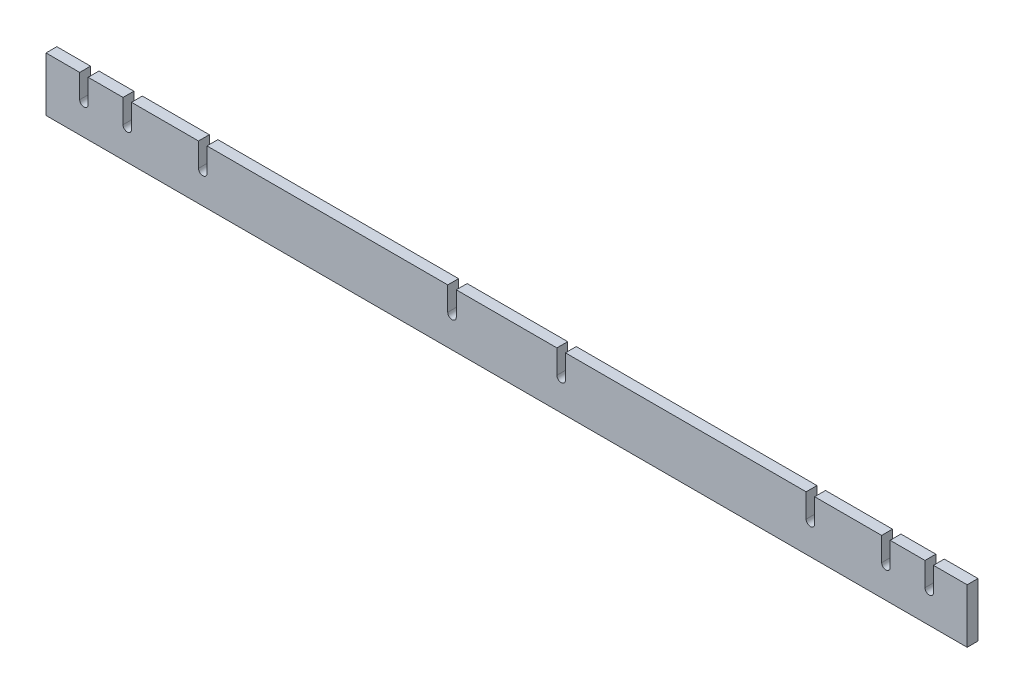
ISO-10303-21;
HEADER;
FILE_DESCRIPTION(('STEP AP214'),'2;1');
FILE_NAME('part.step','',(''),(''),'','','');
FILE_SCHEMA(('AUTOMOTIVE_DESIGN { 1 0 10303 214 1 1 1 1 }'));
ENDSEC;
DATA;
#1=APPLICATION_CONTEXT('core data for automotive mechanical design processes');
#2=APPLICATION_PROTOCOL_DEFINITION('international standard','automotive_design',2000,#1);
#3=PRODUCT_CONTEXT('',#1,'mechanical');
#4=PRODUCT('Part','Part','',(#3));
#5=PRODUCT_RELATED_PRODUCT_CATEGORY('part','',(#4));
#6=PRODUCT_DEFINITION_FORMATION('','',#4);
#7=PRODUCT_DEFINITION_CONTEXT('part definition',#1,'design');
#8=PRODUCT_DEFINITION('design','',#6,#7);
#9=PRODUCT_DEFINITION_SHAPE('','',#8);
#10=(LENGTH_UNIT() NAMED_UNIT(*) SI_UNIT(.MILLI.,.METRE.));
#11=(NAMED_UNIT(*) PLANE_ANGLE_UNIT() SI_UNIT($,.RADIAN.));
#12=(NAMED_UNIT(*) SI_UNIT($,.STERADIAN.) SOLID_ANGLE_UNIT());
#13=UNCERTAINTY_MEASURE_WITH_UNIT(LENGTH_MEASURE(1.E-05),#10,'distance_accuracy_value','');
#14=(GEOMETRIC_REPRESENTATION_CONTEXT(3) GLOBAL_UNCERTAINTY_ASSIGNED_CONTEXT((#13)) GLOBAL_UNIT_ASSIGNED_CONTEXT((#10,
#11,#12)) REPRESENTATION_CONTEXT('',''));
#15=CARTESIAN_POINT('',(0.,0.,0.));
#16=DIRECTION('',(0.,0.,1.));
#17=DIRECTION('',(1.,0.,0.));
#18=AXIS2_PLACEMENT_3D('',#15,#16,#17);
#19=CARTESIAN_POINT('',(-539.749999999999,1028.7,12.7));
#20=DIRECTION('',(0.,-1.,0.));
#21=DIRECTION('',(1.,0.,0.));
#22=AXIS2_PLACEMENT_3D('',#19,#20,#21);
#23=PLANE('',#22);
#24=DIRECTION('',(-1.,0.,0.));
#25=VECTOR('',#24,1.);
#26=CARTESIAN_POINT('',(-539.749999999999,1028.7,0.));
#27=LINE('',#26,#25);
#28=CARTESIAN_POINT('',(539.749999999999,1028.7,0.));
#29=VERTEX_POINT('',#28);
#30=CARTESIAN_POINT('',(500.253,1028.7,0.));
#31=VERTEX_POINT('',#30);
#32=EDGE_CURVE('E305',#29,#31,#27,.T.);
#33=ORIENTED_EDGE('',*,*,#32,.T.);
#34=DIRECTION('',(0.,0.,-1.));
#35=VECTOR('',#34,1.);
#36=CARTESIAN_POINT('',(500.253,1028.7,20.32));
#37=LINE('',#36,#35);
#38=CARTESIAN_POINT('',(500.253,1028.7,12.7));
#39=VERTEX_POINT('',#38);
#40=EDGE_CURVE('E299',#39,#31,#37,.T.);
#41=ORIENTED_EDGE('',*,*,#40,.F.);
#42=DIRECTION('',(-1.,0.,0.));
#43=VECTOR('',#42,1.);
#44=CARTESIAN_POINT('',(-539.749999999999,1028.7,12.7));
#45=LINE('',#44,#43);
#46=CARTESIAN_POINT('',(539.749999999999,1028.7,12.7));
#47=VERTEX_POINT('',#46);
#48=EDGE_CURVE('E320',#47,#39,#45,.T.);
#49=ORIENTED_EDGE('',*,*,#48,.F.);
#50=DIRECTION('',(0.,0.,-1.));
#51=VECTOR('',#50,1.);
#52=CARTESIAN_POINT('',(539.749999999999,1028.7,12.7));
#53=LINE('',#52,#51);
#54=EDGE_CURVE('E319',#47,#29,#53,.T.);
#55=ORIENTED_EDGE('',*,*,#54,.T.);
#56=EDGE_LOOP('',(#33,#41,#49,#55));
#57=FACE_BOUND('',#56,.T.);
#58=ADVANCED_FACE('F39',(#57),#23,.F.);
#59=CARTESIAN_POINT('',(490.347,1028.7,12.7));
#60=VERTEX_POINT('',#59);
#61=CARTESIAN_POINT('',(449.453,1028.7,12.7));
#62=VERTEX_POINT('',#61);
#63=EDGE_CURVE('E298',#60,#62,#45,.T.);
#64=ORIENTED_EDGE('',*,*,#63,.F.);
#65=DIRECTION('',(0.,0.,-1.));
#66=VECTOR('',#65,1.);
#67=CARTESIAN_POINT('',(490.347,1028.7,20.32));
#68=LINE('',#67,#66);
#69=CARTESIAN_POINT('',(490.347,1028.7,0.));
#70=VERTEX_POINT('',#69);
#71=EDGE_CURVE('E285',#60,#70,#68,.T.);
#72=ORIENTED_EDGE('',*,*,#71,.T.);
#73=CARTESIAN_POINT('',(449.453,1028.7,0.));
#74=VERTEX_POINT('',#73);
#75=EDGE_CURVE('E296',#70,#74,#27,.T.);
#76=ORIENTED_EDGE('',*,*,#75,.T.);
#77=DIRECTION('',(0.,0.,-1.));
#78=VECTOR('',#77,1.);
#79=CARTESIAN_POINT('',(449.453,1028.7,20.32));
#80=LINE('',#79,#78);
#81=EDGE_CURVE('E529',#62,#74,#80,.T.);
#82=ORIENTED_EDGE('',*,*,#81,.F.);
#83=EDGE_LOOP('',(#64,#72,#76,#82));
#84=FACE_BOUND('',#83,.T.);
#85=ADVANCED_FACE('F294',(#84),#23,.F.);
#86=CARTESIAN_POINT('',(-361.05,1028.7,0.));
#87=VERTEX_POINT('',#86);
#88=CARTESIAN_POINT('',(-439.547,1028.7,0.));
#89=VERTEX_POINT('',#88);
#90=EDGE_CURVE('E337',#87,#89,#27,.T.);
#91=ORIENTED_EDGE('',*,*,#90,.T.);
#92=DIRECTION('',(0.,0.,-1.));
#93=VECTOR('',#92,1.);
#94=CARTESIAN_POINT('',(-439.547,1028.7,20.32));
#95=LINE('',#94,#93);
#96=CARTESIAN_POINT('',(-439.547,1028.7,12.7));
#97=VERTEX_POINT('',#96);
#98=EDGE_CURVE('E506',#97,#89,#95,.T.);
#99=ORIENTED_EDGE('',*,*,#98,.F.);
#100=CARTESIAN_POINT('',(-361.05,1028.7,12.7));
#101=VERTEX_POINT('',#100);
#102=EDGE_CURVE('E625',#101,#97,#45,.T.);
#103=ORIENTED_EDGE('',*,*,#102,.F.);
#104=DIRECTION('',(0.,0.,-1.));
#105=VECTOR('',#104,1.);
#106=CARTESIAN_POINT('',(-361.05,1028.7,12.7));
#107=LINE('',#106,#105);
#108=EDGE_CURVE('E423',#101,#87,#107,.T.);
#109=ORIENTED_EDGE('',*,*,#108,.T.);
#110=EDGE_LOOP('',(#91,#99,#103,#109));
#111=FACE_BOUND('',#110,.T.);
#112=ADVANCED_FACE('F644',(#111),#23,.F.);
#113=CARTESIAN_POINT('',(-449.453,1028.7,12.7));
#114=VERTEX_POINT('',#113);
#115=CARTESIAN_POINT('',(-490.347,1028.7,12.7));
#116=VERTEX_POINT('',#115);
#117=EDGE_CURVE('E620',#114,#116,#45,.T.);
#118=ORIENTED_EDGE('',*,*,#117,.F.);
#119=DIRECTION('',(0.,0.,-1.));
#120=VECTOR('',#119,1.);
#121=CARTESIAN_POINT('',(-449.453,1028.7,20.32));
#122=LINE('',#121,#120);
#123=CARTESIAN_POINT('',(-449.453,1028.7,0.));
#124=VERTEX_POINT('',#123);
#125=EDGE_CURVE('E501',#114,#124,#122,.T.);
#126=ORIENTED_EDGE('',*,*,#125,.T.);
#127=CARTESIAN_POINT('',(-490.347,1028.7,0.));
#128=VERTEX_POINT('',#127);
#129=EDGE_CURVE('E311',#124,#128,#27,.T.);
#130=ORIENTED_EDGE('',*,*,#129,.T.);
#131=DIRECTION('',(0.,0.,-1.));
#132=VECTOR('',#131,1.);
#133=CARTESIAN_POINT('',(-490.347,1028.7,20.32));
#134=LINE('',#133,#132);
#135=EDGE_CURVE('E476',#116,#128,#134,.T.);
#136=ORIENTED_EDGE('',*,*,#135,.F.);
#137=EDGE_LOOP('',(#118,#126,#130,#136));
#138=FACE_BOUND('',#137,.T.);
#139=ADVANCED_FACE('F634',(#138),#23,.F.);
#140=CARTESIAN_POINT('',(-500.253,1028.7,12.7));
#141=VERTEX_POINT('',#140);
#142=CARTESIAN_POINT('',(-539.749999999999,1028.7,12.7));
#143=VERTEX_POINT('',#142);
#144=EDGE_CURVE('E347',#141,#143,#45,.T.);
#145=ORIENTED_EDGE('',*,*,#144,.F.);
#146=DIRECTION('',(0.,0.,-1.));
#147=VECTOR('',#146,1.);
#148=CARTESIAN_POINT('',(-500.253,1028.7,20.32));
#149=LINE('',#148,#147);
#150=CARTESIAN_POINT('',(-500.253,1028.7,0.));
#151=VERTEX_POINT('',#150);
#152=EDGE_CURVE('E471',#141,#151,#149,.T.);
#153=ORIENTED_EDGE('',*,*,#152,.T.);
#154=CARTESIAN_POINT('',(-539.749999999999,1028.7,0.));
#155=VERTEX_POINT('',#154);
#156=EDGE_CURVE('E335',#151,#155,#27,.T.);
#157=ORIENTED_EDGE('',*,*,#156,.T.);
#158=DIRECTION('',(0.,0.,-1.));
#159=VECTOR('',#158,1.);
#160=CARTESIAN_POINT('',(-539.749999999999,1028.7,12.7));
#161=LINE('',#160,#159);
#162=EDGE_CURVE('E316',#143,#155,#161,.T.);
#163=ORIENTED_EDGE('',*,*,#162,.F.);
#164=EDGE_LOOP('',(#145,#153,#157,#163));
#165=FACE_BOUND('',#164,.T.);
#166=ADVANCED_FACE('F568',(#165),#23,.F.);
#167=CARTESIAN_POINT('',(-68.95,1028.7,0.));
#168=VERTEX_POINT('',#167);
#169=CARTESIAN_POINT('',(-351.05,1028.7,0.));
#170=VERTEX_POINT('',#169);
#171=EDGE_CURVE('E589',#168,#170,#27,.T.);
#172=ORIENTED_EDGE('',*,*,#171,.T.);
#173=DIRECTION('',(0.,0.,-1.));
#174=VECTOR('',#173,1.);
#175=CARTESIAN_POINT('',(-351.05,1028.7,12.7));
#176=LINE('',#175,#174);
#177=CARTESIAN_POINT('',(-351.05,1028.7,12.7));
#178=VERTEX_POINT('',#177);
#179=EDGE_CURVE('E431',#178,#170,#176,.T.);
#180=ORIENTED_EDGE('',*,*,#179,.F.);
#181=CARTESIAN_POINT('',(-68.95,1028.7,12.7));
#182=VERTEX_POINT('',#181);
#183=EDGE_CURVE('E622',#182,#178,#45,.T.);
#184=ORIENTED_EDGE('',*,*,#183,.F.);
#185=DIRECTION('',(0.,0.,-1.));
#186=VECTOR('',#185,1.);
#187=CARTESIAN_POINT('',(-68.95,1028.7,12.7));
#188=LINE('',#187,#186);
#189=EDGE_CURVE('E397',#182,#168,#188,.T.);
#190=ORIENTED_EDGE('',*,*,#189,.T.);
#191=EDGE_LOOP('',(#172,#180,#184,#190));
#192=FACE_BOUND('',#191,.T.);
#193=ADVANCED_FACE('F662',(#192),#23,.F.);
#194=CARTESIAN_POINT('',(58.95,1028.7,0.));
#195=VERTEX_POINT('',#194);
#196=CARTESIAN_POINT('',(-58.9499999999999,1028.7,0.));
#197=VERTEX_POINT('',#196);
#198=EDGE_CURVE('E594',#195,#197,#27,.T.);
#199=ORIENTED_EDGE('',*,*,#198,.T.);
#200=DIRECTION('',(0.,0.,-1.));
#201=VECTOR('',#200,1.);
#202=CARTESIAN_POINT('',(-58.9499999999999,1028.7,12.7));
#203=LINE('',#202,#201);
#204=CARTESIAN_POINT('',(-58.9499999999999,1028.7,12.7));
#205=VERTEX_POINT('',#204);
#206=EDGE_CURVE('E405',#205,#197,#203,.T.);
#207=ORIENTED_EDGE('',*,*,#206,.F.);
#208=CARTESIAN_POINT('',(58.95,1028.7,12.7));
#209=VERTEX_POINT('',#208);
#210=EDGE_CURVE('E619',#209,#205,#45,.T.);
#211=ORIENTED_EDGE('',*,*,#210,.F.);
#212=DIRECTION('',(0.,0.,-1.));
#213=VECTOR('',#212,1.);
#214=CARTESIAN_POINT('',(58.95,1028.7,12.7));
#215=LINE('',#214,#213);
#216=EDGE_CURVE('E371',#209,#195,#215,.T.);
#217=ORIENTED_EDGE('',*,*,#216,.T.);
#218=EDGE_LOOP('',(#199,#207,#211,#217));
#219=FACE_BOUND('',#218,.T.);
#220=ADVANCED_FACE('F664',(#219),#23,.F.);
#221=CARTESIAN_POINT('',(439.547,1028.7,12.7));
#222=VERTEX_POINT('',#221);
#223=CARTESIAN_POINT('',(361.05,1028.7,12.7));
#224=VERTEX_POINT('',#223);
#225=EDGE_CURVE('E618',#222,#224,#45,.T.);
#226=ORIENTED_EDGE('',*,*,#225,.F.);
#227=DIRECTION('',(0.,0.,-1.));
#228=VECTOR('',#227,1.);
#229=CARTESIAN_POINT('',(439.547,1028.7,20.32));
#230=LINE('',#229,#228);
#231=CARTESIAN_POINT('',(439.547,1028.7,0.));
#232=VERTEX_POINT('',#231);
#233=EDGE_CURVE('E526',#222,#232,#230,.T.);
#234=ORIENTED_EDGE('',*,*,#233,.T.);
#235=CARTESIAN_POINT('',(361.05,1028.7,0.));
#236=VERTEX_POINT('',#235);
#237=EDGE_CURVE('E306',#232,#236,#27,.T.);
#238=ORIENTED_EDGE('',*,*,#237,.T.);
#239=DIRECTION('',(0.,0.,-1.));
#240=VECTOR('',#239,1.);
#241=CARTESIAN_POINT('',(361.05,1028.7,12.7));
#242=LINE('',#241,#240);
#243=EDGE_CURVE('E340',#224,#236,#242,.T.);
#244=ORIENTED_EDGE('',*,*,#243,.F.);
#245=EDGE_LOOP('',(#226,#234,#238,#244));
#246=FACE_BOUND('',#245,.T.);
#247=ADVANCED_FACE('F670',(#246),#23,.F.);
#248=CARTESIAN_POINT('',(-539.749999999999,1028.7,12.7));
#249=DIRECTION('',(1.,0.,0.));
#250=DIRECTION('',(0.,0.,-1.));
#251=AXIS2_PLACEMENT_3D('',#248,#249,#250);
#252=PLANE('',#251);
#253=DIRECTION('',(0.,-1.,0.));
#254=VECTOR('',#253,1.);
#255=CARTESIAN_POINT('',(-539.749999999999,1028.7,0.));
#256=LINE('',#255,#254);
#257=CARTESIAN_POINT('',(-539.749999999999,965.2,0.));
#258=VERTEX_POINT('',#257);
#259=EDGE_CURVE('E338',#155,#258,#256,.T.);
#260=ORIENTED_EDGE('',*,*,#259,.T.);
#261=DIRECTION('',(0.,0.,-1.));
#262=VECTOR('',#261,1.);
#263=CARTESIAN_POINT('',(-539.749999999999,965.2,12.7));
#264=LINE('',#263,#262);
#265=CARTESIAN_POINT('',(-539.749999999999,965.2,12.7));
#266=VERTEX_POINT('',#265);
#267=EDGE_CURVE('E11',#266,#258,#264,.T.);
#268=ORIENTED_EDGE('',*,*,#267,.F.);
#269=DIRECTION('',(0.,-1.,0.));
#270=VECTOR('',#269,1.);
#271=CARTESIAN_POINT('',(-539.749999999999,1028.7,12.7));
#272=LINE('',#271,#270);
#273=EDGE_CURVE('E309',#143,#266,#272,.T.);
#274=ORIENTED_EDGE('',*,*,#273,.F.);
#275=ORIENTED_EDGE('',*,*,#162,.T.);
#276=EDGE_LOOP('',(#260,#268,#274,#275));
#277=FACE_BOUND('',#276,.T.);
#278=ADVANCED_FACE('F41',(#277),#252,.F.);
#279=CARTESIAN_POINT('',(-539.749999999999,965.2,12.7));
#280=DIRECTION('',(0.,1.,0.));
#281=DIRECTION('',(-1.,0.,0.));
#282=AXIS2_PLACEMENT_3D('',#279,#280,#281);
#283=PLANE('',#282);
#284=DIRECTION('',(1.,0.,0.));
#285=VECTOR('',#284,1.);
#286=CARTESIAN_POINT('',(-539.749999999999,965.2,0.));
#287=LINE('',#286,#285);
#288=CARTESIAN_POINT('',(539.749999999999,965.2,0.));
#289=VERTEX_POINT('',#288);
#290=EDGE_CURVE('E333',#258,#289,#287,.T.);
#291=ORIENTED_EDGE('',*,*,#290,.T.);
#292=DIRECTION('',(0.,0.,-1.));
#293=VECTOR('',#292,1.);
#294=CARTESIAN_POINT('',(539.749999999999,965.2,12.7));
#295=LINE('',#294,#293);
#296=CARTESIAN_POINT('',(539.749999999999,965.2,12.7));
#297=VERTEX_POINT('',#296);
#298=EDGE_CURVE('E47',#297,#289,#295,.T.);
#299=ORIENTED_EDGE('',*,*,#298,.F.);
#300=DIRECTION('',(1.,0.,0.));
#301=VECTOR('',#300,1.);
#302=CARTESIAN_POINT('',(-539.749999999999,965.2,12.7));
#303=LINE('',#302,#301);
#304=EDGE_CURVE('E348',#266,#297,#303,.T.);
#305=ORIENTED_EDGE('',*,*,#304,.F.);
#306=ORIENTED_EDGE('',*,*,#267,.T.);
#307=EDGE_LOOP('',(#291,#299,#305,#306));
#308=FACE_BOUND('',#307,.T.);
#309=ADVANCED_FACE('F560',(#308),#283,.F.);
#310=CARTESIAN_POINT('',(539.749999999999,1028.7,12.7));
#311=DIRECTION('',(-1.,0.,0.));
#312=DIRECTION('',(0.,0.,1.));
#313=AXIS2_PLACEMENT_3D('',#310,#311,#312);
#314=PLANE('',#313);
#315=DIRECTION('',(0.,1.,0.));
#316=VECTOR('',#315,1.);
#317=CARTESIAN_POINT('',(539.749999999999,1028.7,0.));
#318=LINE('',#317,#316);
#319=EDGE_CURVE('E314',#289,#29,#318,.T.);
#320=ORIENTED_EDGE('',*,*,#319,.T.);
#321=ORIENTED_EDGE('',*,*,#54,.F.);
#322=DIRECTION('',(0.,1.,0.));
#323=VECTOR('',#322,1.);
#324=CARTESIAN_POINT('',(539.749999999999,1028.7,12.7));
#325=LINE('',#324,#323);
#326=EDGE_CURVE('E329',#297,#47,#325,.T.);
#327=ORIENTED_EDGE('',*,*,#326,.F.);
#328=ORIENTED_EDGE('',*,*,#298,.T.);
#329=EDGE_LOOP('',(#320,#321,#327,#328));
#330=FACE_BOUND('',#329,.T.);
#331=ADVANCED_FACE('F327',(#330),#314,.F.);
#332=CARTESIAN_POINT('',(351.05,1028.7,0.));
#333=VERTEX_POINT('',#332);
#334=CARTESIAN_POINT('',(68.95,1028.7,0.));
#335=VERTEX_POINT('',#334);
#336=EDGE_CURVE('E310',#333,#335,#27,.T.);
#337=ORIENTED_EDGE('',*,*,#336,.T.);
#338=DIRECTION('',(0.,0.,-1.));
#339=VECTOR('',#338,1.);
#340=CARTESIAN_POINT('',(68.95,1028.7,12.7));
#341=LINE('',#340,#339);
#342=CARTESIAN_POINT('',(68.95,1028.7,12.7));
#343=VERTEX_POINT('',#342);
#344=EDGE_CURVE('E379',#343,#335,#341,.T.);
#345=ORIENTED_EDGE('',*,*,#344,.F.);
#346=CARTESIAN_POINT('',(351.05,1028.7,12.7));
#347=VERTEX_POINT('',#346);
#348=EDGE_CURVE('E345',#347,#343,#45,.T.);
#349=ORIENTED_EDGE('',*,*,#348,.F.);
#350=DIRECTION('',(0.,0.,-1.));
#351=VECTOR('',#350,1.);
#352=CARTESIAN_POINT('',(351.05,1028.7,12.7));
#353=LINE('',#352,#351);
#354=EDGE_CURVE('E358',#347,#333,#353,.T.);
#355=ORIENTED_EDGE('',*,*,#354,.T.);
#356=EDGE_LOOP('',(#337,#345,#349,#355));
#357=FACE_BOUND('',#356,.T.);
#358=ADVANCED_FACE('F606',(#357),#23,.F.);
#359=CARTESIAN_POINT('',(-539.749999999999,965.2,12.7));
#360=DIRECTION('',(0.,0.,1.));
#361=DIRECTION('',(1.,0.,0.));
#362=AXIS2_PLACEMENT_3D('',#359,#360,#361);
#363=PLANE('',#362);
#364=DIRECTION('',(0.,1.,0.));
#365=VECTOR('',#364,1.);
#366=CARTESIAN_POINT('',(500.253,965.2,12.7));
#367=LINE('',#366,#365);
#368=CARTESIAN_POINT('',(500.253,1001.014,12.7));
#369=VERTEX_POINT('',#368);
#370=EDGE_CURVE('E538',#369,#39,#367,.T.);
#371=ORIENTED_EDGE('',*,*,#370,.F.);
#372=CARTESIAN_POINT('',(495.3,1001.014,12.7));
#373=DIRECTION('',(0.,0.,1.));
#374=DIRECTION('',(1.,0.,0.));
#375=AXIS2_PLACEMENT_3D('',#372,#373,#374);
#376=CIRCLE('',#375,4.95299999999999);
#377=CARTESIAN_POINT('',(490.347,1001.014,12.7));
#378=VERTEX_POINT('',#377);
#379=EDGE_CURVE('E536',#378,#369,#376,.T.);
#380=ORIENTED_EDGE('',*,*,#379,.F.);
#381=DIRECTION('',(0.,-1.,0.));
#382=VECTOR('',#381,1.);
#383=CARTESIAN_POINT('',(490.347,965.2,12.7));
#384=LINE('',#383,#382);
#385=EDGE_CURVE('E540',#60,#378,#384,.T.);
#386=ORIENTED_EDGE('',*,*,#385,.F.);
#387=ORIENTED_EDGE('',*,*,#63,.T.);
#388=DIRECTION('',(0.,1.,0.));
#389=VECTOR('',#388,1.);
#390=CARTESIAN_POINT('',(449.453,965.2,12.7));
#391=LINE('',#390,#389);
#392=CARTESIAN_POINT('',(449.453,1001.014,12.7));
#393=VERTEX_POINT('',#392);
#394=EDGE_CURVE('E518',#393,#62,#391,.T.);
#395=ORIENTED_EDGE('',*,*,#394,.F.);
#396=CARTESIAN_POINT('',(444.5,1001.014,12.7));
#397=DIRECTION('',(0.,0.,1.));
#398=DIRECTION('',(1.,0.,0.));
#399=AXIS2_PLACEMENT_3D('',#396,#397,#398);
#400=CIRCLE('',#399,4.95299999999993);
#401=CARTESIAN_POINT('',(439.547,1001.014,12.7));
#402=VERTEX_POINT('',#401);
#403=EDGE_CURVE('E516',#402,#393,#400,.T.);
#404=ORIENTED_EDGE('',*,*,#403,.F.);
#405=DIRECTION('',(0.,-1.,0.));
#406=VECTOR('',#405,1.);
#407=CARTESIAN_POINT('',(439.547,965.2,12.7));
#408=LINE('',#407,#406);
#409=EDGE_CURVE('E521',#222,#402,#408,.T.);
#410=ORIENTED_EDGE('',*,*,#409,.F.);
#411=ORIENTED_EDGE('',*,*,#225,.T.);
#412=DIRECTION('',(0.,-1.,0.));
#413=VECTOR('',#412,1.);
#414=CARTESIAN_POINT('',(361.05,1028.7,12.7));
#415=LINE('',#414,#413);
#416=CARTESIAN_POINT('',(361.05,1000.9,12.7));
#417=VERTEX_POINT('',#416);
#418=EDGE_CURVE('E365',#224,#417,#415,.T.);
#419=ORIENTED_EDGE('',*,*,#418,.T.);
#420=CARTESIAN_POINT('',(356.05,1000.9,12.7));
#421=DIRECTION('',(0.,0.,-1.));
#422=DIRECTION('',(-1.,0.,0.));
#423=AXIS2_PLACEMENT_3D('',#420,#421,#422);
#424=CIRCLE('',#423,5.);
#425=CARTESIAN_POINT('',(351.05,1000.9,12.7));
#426=VERTEX_POINT('',#425);
#427=EDGE_CURVE('E374',#417,#426,#424,.T.);
#428=ORIENTED_EDGE('',*,*,#427,.T.);
#429=DIRECTION('',(0.,1.,0.));
#430=VECTOR('',#429,1.);
#431=CARTESIAN_POINT('',(351.05,1028.7,12.7));
#432=LINE('',#431,#430);
#433=EDGE_CURVE('E356',#426,#347,#432,.T.);
#434=ORIENTED_EDGE('',*,*,#433,.T.);
#435=ORIENTED_EDGE('',*,*,#348,.T.);
#436=DIRECTION('',(0.,-1.,0.));
#437=VECTOR('',#436,1.);
#438=CARTESIAN_POINT('',(68.95,1028.7,12.7));
#439=LINE('',#438,#437);
#440=CARTESIAN_POINT('',(68.95,1000.9,12.7));
#441=VERTEX_POINT('',#440);
#442=EDGE_CURVE('E390',#343,#441,#439,.T.);
#443=ORIENTED_EDGE('',*,*,#442,.T.);
#444=CARTESIAN_POINT('',(63.95,1000.9,12.7));
#445=DIRECTION('',(0.,0.,-1.));
#446=DIRECTION('',(-1.,0.,0.));
#447=AXIS2_PLACEMENT_3D('',#444,#445,#446);
#448=CIRCLE('',#447,5.00000000000001);
#449=CARTESIAN_POINT('',(58.95,1000.9,12.7));
#450=VERTEX_POINT('',#449);
#451=EDGE_CURVE('E400',#441,#450,#448,.T.);
#452=ORIENTED_EDGE('',*,*,#451,.T.);
#453=DIRECTION('',(0.,1.,0.));
#454=VECTOR('',#453,1.);
#455=CARTESIAN_POINT('',(58.95,1028.7,12.7));
#456=LINE('',#455,#454);
#457=EDGE_CURVE('E382',#450,#209,#456,.T.);
#458=ORIENTED_EDGE('',*,*,#457,.T.);
#459=ORIENTED_EDGE('',*,*,#210,.T.);
#460=DIRECTION('',(0.,-1.,0.));
#461=VECTOR('',#460,1.);
#462=CARTESIAN_POINT('',(-58.9499999999999,1028.7,12.7));
#463=LINE('',#462,#461);
#464=CARTESIAN_POINT('',(-58.95,1000.9,12.7));
#465=VERTEX_POINT('',#464);
#466=EDGE_CURVE('E416',#205,#465,#463,.T.);
#467=ORIENTED_EDGE('',*,*,#466,.T.);
#468=CARTESIAN_POINT('',(-63.95,1000.9,12.7));
#469=DIRECTION('',(0.,0.,-1.));
#470=DIRECTION('',(-1.,0.,0.));
#471=AXIS2_PLACEMENT_3D('',#468,#469,#470);
#472=CIRCLE('',#471,5.);
#473=CARTESIAN_POINT('',(-68.95,1000.9,12.7));
#474=VERTEX_POINT('',#473);
#475=EDGE_CURVE('E426',#465,#474,#472,.T.);
#476=ORIENTED_EDGE('',*,*,#475,.T.);
#477=DIRECTION('',(0.,1.,0.));
#478=VECTOR('',#477,1.);
#479=CARTESIAN_POINT('',(-68.95,1028.7,12.7));
#480=LINE('',#479,#478);
#481=EDGE_CURVE('E408',#474,#182,#480,.T.);
#482=ORIENTED_EDGE('',*,*,#481,.T.);
#483=ORIENTED_EDGE('',*,*,#183,.T.);
#484=DIRECTION('',(0.,-1.,0.));
#485=VECTOR('',#484,1.);
#486=CARTESIAN_POINT('',(-351.05,1028.7,12.7));
#487=LINE('',#486,#485);
#488=CARTESIAN_POINT('',(-351.05,1000.9,12.7));
#489=VERTEX_POINT('',#488);
#490=EDGE_CURVE('E442',#178,#489,#487,.T.);
#491=ORIENTED_EDGE('',*,*,#490,.T.);
#492=CARTESIAN_POINT('',(-356.05,1000.9,12.7));
#493=DIRECTION('',(0.,0.,-1.));
#494=DIRECTION('',(-1.,0.,0.));
#495=AXIS2_PLACEMENT_3D('',#492,#493,#494);
#496=CIRCLE('',#495,5.);
#497=CARTESIAN_POINT('',(-361.05,1000.9,12.7));
#498=VERTEX_POINT('',#497);
#499=EDGE_CURVE('E452',#489,#498,#496,.T.);
#500=ORIENTED_EDGE('',*,*,#499,.T.);
#501=DIRECTION('',(0.,1.,0.));
#502=VECTOR('',#501,1.);
#503=CARTESIAN_POINT('',(-361.05,1028.7,12.7));
#504=LINE('',#503,#502);
#505=EDGE_CURVE('E434',#498,#101,#504,.T.);
#506=ORIENTED_EDGE('',*,*,#505,.T.);
#507=ORIENTED_EDGE('',*,*,#102,.T.);
#508=DIRECTION('',(0.,1.,0.));
#509=VECTOR('',#508,1.);
#510=CARTESIAN_POINT('',(-439.547,965.2,12.7));
#511=LINE('',#510,#509);
#512=CARTESIAN_POINT('',(-439.547,1001.014,12.7));
#513=VERTEX_POINT('',#512);
#514=EDGE_CURVE('E493',#513,#97,#511,.T.);
#515=ORIENTED_EDGE('',*,*,#514,.F.);
#516=CARTESIAN_POINT('',(-444.5,1001.014,12.7));
#517=DIRECTION('',(0.,0.,1.));
#518=DIRECTION('',(1.,0.,0.));
#519=AXIS2_PLACEMENT_3D('',#516,#517,#518);
#520=CIRCLE('',#519,4.95299999999999);
#521=CARTESIAN_POINT('',(-449.453,1001.014,12.7));
#522=VERTEX_POINT('',#521);
#523=EDGE_CURVE('E491',#522,#513,#520,.T.);
#524=ORIENTED_EDGE('',*,*,#523,.F.);
#525=DIRECTION('',(0.,-1.,0.));
#526=VECTOR('',#525,1.);
#527=CARTESIAN_POINT('',(-449.453,965.2,12.7));
#528=LINE('',#527,#526);
#529=EDGE_CURVE('E495',#114,#522,#528,.T.);
#530=ORIENTED_EDGE('',*,*,#529,.F.);
#531=ORIENTED_EDGE('',*,*,#117,.T.);
#532=DIRECTION('',(0.,1.,0.));
#533=VECTOR('',#532,1.);
#534=CARTESIAN_POINT('',(-490.347,965.2,12.7));
#535=LINE('',#534,#533);
#536=CARTESIAN_POINT('',(-490.347,1001.014,12.7));
#537=VERTEX_POINT('',#536);
#538=EDGE_CURVE('E459',#537,#116,#535,.T.);
#539=ORIENTED_EDGE('',*,*,#538,.F.);
#540=CARTESIAN_POINT('',(-495.3,1001.014,12.7));
#541=DIRECTION('',(0.,0.,1.));
#542=DIRECTION('',(1.,0.,0.));
#543=AXIS2_PLACEMENT_3D('',#540,#541,#542);
#544=CIRCLE('',#543,4.95299999999996);
#545=CARTESIAN_POINT('',(-500.253,1001.014,12.7));
#546=VERTEX_POINT('',#545);
#547=EDGE_CURVE('E449',#546,#537,#544,.T.);
#548=ORIENTED_EDGE('',*,*,#547,.F.);
#549=DIRECTION('',(0.,-1.,0.));
#550=VECTOR('',#549,1.);
#551=CARTESIAN_POINT('',(-500.253,965.2,12.7));
#552=LINE('',#551,#550);
#553=EDGE_CURVE('E463',#141,#546,#552,.T.);
#554=ORIENTED_EDGE('',*,*,#553,.F.);
#555=ORIENTED_EDGE('',*,*,#144,.T.);
#556=ORIENTED_EDGE('',*,*,#273,.T.);
#557=ORIENTED_EDGE('',*,*,#304,.T.);
#558=ORIENTED_EDGE('',*,*,#326,.T.);
#559=ORIENTED_EDGE('',*,*,#48,.T.);
#560=EDGE_LOOP('',(#371,#380,#386,#387,#395,#404,#410,#411,#419,#428,#434,#435,#443,#452,#458,
#459,#467,#476,#482,#483,#491,#500,#506,#507,#515,#524,#530,#531,#539,#548,#554,#555,#556,#557,
#558,#559));
#561=FACE_BOUND('',#560,.T.);
#562=ADVANCED_FACE('F556',(#561),#363,.T.);
#563=CARTESIAN_POINT('',(-539.749999999999,965.2,0.));
#564=DIRECTION('',(0.,0.,1.));
#565=DIRECTION('',(1.,0.,0.));
#566=AXIS2_PLACEMENT_3D('',#563,#564,#565);
#567=PLANE('',#566);
#568=CARTESIAN_POINT('',(495.3,1001.014,0.));
#569=DIRECTION('',(0.,0.,-1.));
#570=DIRECTION('',(-1.,0.,0.));
#571=AXIS2_PLACEMENT_3D('',#568,#569,#570);
#572=CIRCLE('',#571,4.95299999999999);
#573=CARTESIAN_POINT('',(500.253,1001.014,0.));
#574=VERTEX_POINT('',#573);
#575=CARTESIAN_POINT('',(490.347,1001.014,0.));
#576=VERTEX_POINT('',#575);
#577=EDGE_CURVE('E54',#574,#576,#572,.T.);
#578=ORIENTED_EDGE('',*,*,#577,.F.);
#579=DIRECTION('',(0.,-1.,0.));
#580=VECTOR('',#579,1.);
#581=CARTESIAN_POINT('',(500.253,1028.7,0.));
#582=LINE('',#581,#580);
#583=EDGE_CURVE('E290',#31,#574,#582,.T.);
#584=ORIENTED_EDGE('',*,*,#583,.F.);
#585=ORIENTED_EDGE('',*,*,#32,.F.);
#586=ORIENTED_EDGE('',*,*,#319,.F.);
#587=ORIENTED_EDGE('',*,*,#290,.F.);
#588=ORIENTED_EDGE('',*,*,#259,.F.);
#589=ORIENTED_EDGE('',*,*,#156,.F.);
#590=DIRECTION('',(0.,1.,0.));
#591=VECTOR('',#590,1.);
#592=CARTESIAN_POINT('',(-500.253,1001.014,0.));
#593=LINE('',#592,#591);
#594=CARTESIAN_POINT('',(-500.253,1001.014,0.));
#595=VERTEX_POINT('',#594);
#596=EDGE_CURVE('E485',#595,#151,#593,.T.);
#597=ORIENTED_EDGE('',*,*,#596,.F.);
#598=CARTESIAN_POINT('',(-495.3,1001.014,0.));
#599=DIRECTION('',(0.,0.,-1.));
#600=DIRECTION('',(-1.,0.,0.));
#601=AXIS2_PLACEMENT_3D('',#598,#599,#600);
#602=CIRCLE('',#601,4.95299999999996);
#603=CARTESIAN_POINT('',(-490.347,1001.014,0.));
#604=VERTEX_POINT('',#603);
#605=EDGE_CURVE('E488',#604,#595,#602,.T.);
#606=ORIENTED_EDGE('',*,*,#605,.F.);
#607=DIRECTION('',(0.,-1.,0.));
#608=VECTOR('',#607,1.);
#609=CARTESIAN_POINT('',(-490.347,1001.014,0.));
#610=LINE('',#609,#608);
#611=EDGE_CURVE('E472',#128,#604,#610,.T.);
#612=ORIENTED_EDGE('',*,*,#611,.F.);
#613=ORIENTED_EDGE('',*,*,#129,.F.);
#614=DIRECTION('',(0.,1.,0.));
#615=VECTOR('',#614,1.);
#616=CARTESIAN_POINT('',(-449.453,1001.014,0.));
#617=LINE('',#616,#615);
#618=CARTESIAN_POINT('',(-449.453,1001.014,0.));
#619=VERTEX_POINT('',#618);
#620=EDGE_CURVE('E511',#619,#124,#617,.T.);
#621=ORIENTED_EDGE('',*,*,#620,.F.);
#622=CARTESIAN_POINT('',(-444.5,1001.014,0.));
#623=DIRECTION('',(0.,0.,-1.));
#624=DIRECTION('',(-1.,0.,0.));
#625=AXIS2_PLACEMENT_3D('',#622,#623,#624);
#626=CIRCLE('',#625,4.95299999999999);
#627=CARTESIAN_POINT('',(-439.547,1001.014,0.));
#628=VERTEX_POINT('',#627);
#629=EDGE_CURVE('E514',#628,#619,#626,.T.);
#630=ORIENTED_EDGE('',*,*,#629,.F.);
#631=DIRECTION('',(0.,-1.,0.));
#632=VECTOR('',#631,1.);
#633=CARTESIAN_POINT('',(-439.547,1001.014,0.));
#634=LINE('',#633,#632);
#635=EDGE_CURVE('E502',#89,#628,#634,.T.);
#636=ORIENTED_EDGE('',*,*,#635,.F.);
#637=ORIENTED_EDGE('',*,*,#90,.F.);
#638=DIRECTION('',(0.,1.,0.));
#639=VECTOR('',#638,1.);
#640=CARTESIAN_POINT('',(-361.05,1028.7,0.));
#641=LINE('',#640,#639);
#642=CARTESIAN_POINT('',(-361.05,1000.9,0.));
#643=VERTEX_POINT('',#642);
#644=EDGE_CURVE('E440',#643,#87,#641,.T.);
#645=ORIENTED_EDGE('',*,*,#644,.F.);
#646=CARTESIAN_POINT('',(-356.05,1000.9,0.));
#647=DIRECTION('',(0.,0.,-1.));
#648=DIRECTION('',(-1.,0.,0.));
#649=AXIS2_PLACEMENT_3D('',#646,#647,#648);
#650=CIRCLE('',#649,5.);
#651=CARTESIAN_POINT('',(-351.05,1000.9,0.));
#652=VERTEX_POINT('',#651);
#653=EDGE_CURVE('E443',#652,#643,#650,.T.);
#654=ORIENTED_EDGE('',*,*,#653,.F.);
#655=DIRECTION('',(0.,-1.,0.));
#656=VECTOR('',#655,1.);
#657=CARTESIAN_POINT('',(-351.05,1028.7,0.));
#658=LINE('',#657,#656);
#659=EDGE_CURVE('E446',#170,#652,#658,.T.);
#660=ORIENTED_EDGE('',*,*,#659,.F.);
#661=ORIENTED_EDGE('',*,*,#171,.F.);
#662=DIRECTION('',(0.,1.,0.));
#663=VECTOR('',#662,1.);
#664=CARTESIAN_POINT('',(-68.95,1028.7,0.));
#665=LINE('',#664,#663);
#666=CARTESIAN_POINT('',(-68.95,1000.9,0.));
#667=VERTEX_POINT('',#666);
#668=EDGE_CURVE('E414',#667,#168,#665,.T.);
#669=ORIENTED_EDGE('',*,*,#668,.F.);
#670=CARTESIAN_POINT('',(-63.95,1000.9,0.));
#671=DIRECTION('',(0.,0.,-1.));
#672=DIRECTION('',(-1.,0.,0.));
#673=AXIS2_PLACEMENT_3D('',#670,#671,#672);
#674=CIRCLE('',#673,5.);
#675=CARTESIAN_POINT('',(-58.95,1000.9,0.));
#676=VERTEX_POINT('',#675);
#677=EDGE_CURVE('E417',#676,#667,#674,.T.);
#678=ORIENTED_EDGE('',*,*,#677,.F.);
#679=DIRECTION('',(0.,-1.,0.));
#680=VECTOR('',#679,1.);
#681=CARTESIAN_POINT('',(-58.9499999999999,1028.7,0.));
#682=LINE('',#681,#680);
#683=EDGE_CURVE('E420',#197,#676,#682,.T.);
#684=ORIENTED_EDGE('',*,*,#683,.F.);
#685=ORIENTED_EDGE('',*,*,#198,.F.);
#686=DIRECTION('',(0.,1.,0.));
#687=VECTOR('',#686,1.);
#688=CARTESIAN_POINT('',(58.95,1028.7,0.));
#689=LINE('',#688,#687);
#690=CARTESIAN_POINT('',(58.95,1000.9,0.));
#691=VERTEX_POINT('',#690);
#692=EDGE_CURVE('E388',#691,#195,#689,.T.);
#693=ORIENTED_EDGE('',*,*,#692,.F.);
#694=CARTESIAN_POINT('',(63.95,1000.9,0.));
#695=DIRECTION('',(0.,0.,-1.));
#696=DIRECTION('',(-1.,0.,0.));
#697=AXIS2_PLACEMENT_3D('',#694,#695,#696);
#698=CIRCLE('',#697,5.00000000000001);
#699=CARTESIAN_POINT('',(68.95,1000.9,0.));
#700=VERTEX_POINT('',#699);
#701=EDGE_CURVE('E391',#700,#691,#698,.T.);
#702=ORIENTED_EDGE('',*,*,#701,.F.);
#703=DIRECTION('',(0.,-1.,0.));
#704=VECTOR('',#703,1.);
#705=CARTESIAN_POINT('',(68.95,1028.7,0.));
#706=LINE('',#705,#704);
#707=EDGE_CURVE('E394',#335,#700,#706,.T.);
#708=ORIENTED_EDGE('',*,*,#707,.F.);
#709=ORIENTED_EDGE('',*,*,#336,.F.);
#710=DIRECTION('',(0.,1.,0.));
#711=VECTOR('',#710,1.);
#712=CARTESIAN_POINT('',(351.05,1028.7,0.));
#713=LINE('',#712,#711);
#714=CARTESIAN_POINT('',(351.05,1000.9,0.));
#715=VERTEX_POINT('',#714);
#716=EDGE_CURVE('E363',#715,#333,#713,.T.);
#717=ORIENTED_EDGE('',*,*,#716,.F.);
#718=CARTESIAN_POINT('',(356.05,1000.9,0.));
#719=DIRECTION('',(0.,0.,-1.));
#720=DIRECTION('',(-1.,0.,0.));
#721=AXIS2_PLACEMENT_3D('',#718,#719,#720);
#722=CIRCLE('',#721,5.);
#723=CARTESIAN_POINT('',(361.05,1000.9,0.));
#724=VERTEX_POINT('',#723);
#725=EDGE_CURVE('E366',#724,#715,#722,.T.);
#726=ORIENTED_EDGE('',*,*,#725,.F.);
#727=DIRECTION('',(0.,-1.,0.));
#728=VECTOR('',#727,1.);
#729=CARTESIAN_POINT('',(361.05,1028.7,0.));
#730=LINE('',#729,#728);
#731=EDGE_CURVE('E369',#236,#724,#730,.T.);
#732=ORIENTED_EDGE('',*,*,#731,.F.);
#733=ORIENTED_EDGE('',*,*,#237,.F.);
#734=DIRECTION('',(0.,1.,0.));
#735=VECTOR('',#734,1.);
#736=CARTESIAN_POINT('',(439.547,1001.014,0.));
#737=LINE('',#736,#735);
#738=CARTESIAN_POINT('',(439.547,1001.014,0.));
#739=VERTEX_POINT('',#738);
#740=EDGE_CURVE('E533',#739,#232,#737,.T.);
#741=ORIENTED_EDGE('',*,*,#740,.F.);
#742=CARTESIAN_POINT('',(444.5,1001.014,0.));
#743=DIRECTION('',(0.,0.,-1.));
#744=DIRECTION('',(-1.,0.,0.));
#745=AXIS2_PLACEMENT_3D('',#742,#743,#744);
#746=CIRCLE('',#745,4.95299999999993);
#747=CARTESIAN_POINT('',(449.453,1001.014,0.));
#748=VERTEX_POINT('',#747);
#749=EDGE_CURVE('E62',#748,#739,#746,.T.);
#750=ORIENTED_EDGE('',*,*,#749,.F.);
#751=DIRECTION('',(0.,-1.,0.));
#752=VECTOR('',#751,1.);
#753=CARTESIAN_POINT('',(449.453,1028.7,0.));
#754=LINE('',#753,#752);
#755=EDGE_CURVE('E304',#74,#748,#754,.T.);
#756=ORIENTED_EDGE('',*,*,#755,.F.);
#757=ORIENTED_EDGE('',*,*,#75,.F.);
#758=DIRECTION('',(0.,1.,0.));
#759=VECTOR('',#758,1.);
#760=CARTESIAN_POINT('',(490.347,1001.014,0.));
#761=LINE('',#760,#759);
#762=EDGE_CURVE('E282',#576,#70,#761,.T.);
#763=ORIENTED_EDGE('',*,*,#762,.F.);
#764=EDGE_LOOP('',(#578,#584,#585,#586,#587,#588,#589,#597,#606,#612,#613,#621,#630,#636,#637,
#645,#654,#660,#661,#669,#678,#684,#685,#693,#702,#708,#709,#717,#726,#732,#733,#741,#750,#756,
#757,#763));
#765=FACE_BOUND('',#764,.T.);
#766=ADVANCED_FACE('F302',(#765),#567,.F.);
#767=CARTESIAN_POINT('',(361.05,1028.7,12.7));
#768=DIRECTION('',(1.,0.,0.));
#769=DIRECTION('',(0.,0.,-1.));
#770=AXIS2_PLACEMENT_3D('',#767,#768,#769);
#771=PLANE('',#770);
#772=ORIENTED_EDGE('',*,*,#731,.T.);
#773=DIRECTION('',(0.,0.,-1.));
#774=VECTOR('',#773,1.);
#775=CARTESIAN_POINT('',(361.05,1000.9,12.7));
#776=LINE('',#775,#774);
#777=EDGE_CURVE('E352',#417,#724,#776,.T.);
#778=ORIENTED_EDGE('',*,*,#777,.F.);
#779=ORIENTED_EDGE('',*,*,#418,.F.);
#780=ORIENTED_EDGE('',*,*,#243,.T.);
#781=EDGE_LOOP('',(#772,#778,#779,#780));
#782=FACE_BOUND('',#781,.T.);
#783=ADVANCED_FACE('F695',(#782),#771,.F.);
#784=CARTESIAN_POINT('',(351.05,1028.7,12.7));
#785=DIRECTION('',(-1.,0.,0.));
#786=DIRECTION('',(0.,0.,1.));
#787=AXIS2_PLACEMENT_3D('',#784,#785,#786);
#788=PLANE('',#787);
#789=ORIENTED_EDGE('',*,*,#716,.T.);
#790=ORIENTED_EDGE('',*,*,#354,.F.);
#791=ORIENTED_EDGE('',*,*,#433,.F.);
#792=DIRECTION('',(0.,0.,-1.));
#793=VECTOR('',#792,1.);
#794=CARTESIAN_POINT('',(351.05,1000.9,12.7));
#795=LINE('',#794,#793);
#796=EDGE_CURVE('E355',#426,#715,#795,.T.);
#797=ORIENTED_EDGE('',*,*,#796,.T.);
#798=EDGE_LOOP('',(#789,#790,#791,#797));
#799=FACE_BOUND('',#798,.T.);
#800=ADVANCED_FACE('F701',(#799),#788,.F.);
#801=CARTESIAN_POINT('',(356.05,1000.9,12.7));
#802=DIRECTION('',(0.,0.,-1.));
#803=DIRECTION('',(-1.,0.,0.));
#804=AXIS2_PLACEMENT_3D('',#801,#802,#803);
#805=CYLINDRICAL_SURFACE('',#804,5.);
#806=ORIENTED_EDGE('',*,*,#725,.T.);
#807=ORIENTED_EDGE('',*,*,#796,.F.);
#808=ORIENTED_EDGE('',*,*,#427,.F.);
#809=ORIENTED_EDGE('',*,*,#777,.T.);
#810=EDGE_LOOP('',(#806,#807,#808,#809));
#811=FACE_BOUND('',#810,.T.);
#812=ADVANCED_FACE('F699',(#811),#805,.F.);
#813=CARTESIAN_POINT('',(58.95,1028.7,12.7));
#814=DIRECTION('',(-1.,0.,0.));
#815=DIRECTION('',(0.,-1.,0.));
#816=AXIS2_PLACEMENT_3D('',#813,#814,#815);
#817=PLANE('',#816);
#818=ORIENTED_EDGE('',*,*,#692,.T.);
#819=ORIENTED_EDGE('',*,*,#216,.F.);
#820=ORIENTED_EDGE('',*,*,#457,.F.);
#821=DIRECTION('',(0.,0.,-1.));
#822=VECTOR('',#821,1.);
#823=CARTESIAN_POINT('',(58.95,1000.9,12.7));
#824=LINE('',#823,#822);
#825=EDGE_CURVE('E384',#450,#691,#824,.T.);
#826=ORIENTED_EDGE('',*,*,#825,.T.);
#827=EDGE_LOOP('',(#818,#819,#820,#826));
#828=FACE_BOUND('',#827,.T.);
#829=ADVANCED_FACE('F708',(#828),#817,.F.);
#830=CARTESIAN_POINT('',(63.95,1000.9,12.7));
#831=DIRECTION('',(0.,0.,-1.));
#832=DIRECTION('',(-1.,0.,0.));
#833=AXIS2_PLACEMENT_3D('',#830,#831,#832);
#834=CYLINDRICAL_SURFACE('',#833,5.00000000000001);
#835=ORIENTED_EDGE('',*,*,#701,.T.);
#836=ORIENTED_EDGE('',*,*,#825,.F.);
#837=ORIENTED_EDGE('',*,*,#451,.F.);
#838=DIRECTION('',(0.,0.,-1.));
#839=VECTOR('',#838,1.);
#840=CARTESIAN_POINT('',(68.95,1000.9,12.7));
#841=LINE('',#840,#839);
#842=EDGE_CURVE('E381',#441,#700,#841,.T.);
#843=ORIENTED_EDGE('',*,*,#842,.T.);
#844=EDGE_LOOP('',(#835,#836,#837,#843));
#845=FACE_BOUND('',#844,.T.);
#846=ADVANCED_FACE('F747',(#845),#834,.F.);
#847=CARTESIAN_POINT('',(68.95,1028.7,12.7));
#848=DIRECTION('',(1.,0.,0.));
#849=DIRECTION('',(0.,0.,-1.));
#850=AXIS2_PLACEMENT_3D('',#847,#848,#849);
#851=PLANE('',#850);
#852=ORIENTED_EDGE('',*,*,#707,.T.);
#853=ORIENTED_EDGE('',*,*,#842,.F.);
#854=ORIENTED_EDGE('',*,*,#442,.F.);
#855=ORIENTED_EDGE('',*,*,#344,.T.);
#856=EDGE_LOOP('',(#852,#853,#854,#855));
#857=FACE_BOUND('',#856,.T.);
#858=ADVANCED_FACE('F615',(#857),#851,.F.);
#859=CARTESIAN_POINT('',(-68.95,1028.7,12.7));
#860=DIRECTION('',(-1.,0.,0.));
#861=DIRECTION('',(0.,0.,1.));
#862=AXIS2_PLACEMENT_3D('',#859,#860,#861);
#863=PLANE('',#862);
#864=ORIENTED_EDGE('',*,*,#668,.T.);
#865=ORIENTED_EDGE('',*,*,#189,.F.);
#866=ORIENTED_EDGE('',*,*,#481,.F.);
#867=DIRECTION('',(0.,0.,-1.));
#868=VECTOR('',#867,1.);
#869=CARTESIAN_POINT('',(-68.95,1000.9,12.7));
#870=LINE('',#869,#868);
#871=EDGE_CURVE('E410',#474,#667,#870,.T.);
#872=ORIENTED_EDGE('',*,*,#871,.T.);
#873=EDGE_LOOP('',(#864,#865,#866,#872));
#874=FACE_BOUND('',#873,.T.);
#875=ADVANCED_FACE('F660',(#874),#863,.F.);
#876=CARTESIAN_POINT('',(-63.95,1000.9,12.7));
#877=DIRECTION('',(0.,0.,-1.));
#878=DIRECTION('',(-1.,0.,0.));
#879=AXIS2_PLACEMENT_3D('',#876,#877,#878);
#880=CYLINDRICAL_SURFACE('',#879,5.);
#881=ORIENTED_EDGE('',*,*,#677,.T.);
#882=ORIENTED_EDGE('',*,*,#871,.F.);
#883=ORIENTED_EDGE('',*,*,#475,.F.);
#884=DIRECTION('',(0.,0.,-1.));
#885=VECTOR('',#884,1.);
#886=CARTESIAN_POINT('',(-58.95,1000.9,12.7));
#887=LINE('',#886,#885);
#888=EDGE_CURVE('E407',#465,#676,#887,.T.);
#889=ORIENTED_EDGE('',*,*,#888,.T.);
#890=EDGE_LOOP('',(#881,#882,#883,#889));
#891=FACE_BOUND('',#890,.T.);
#892=ADVANCED_FACE('F772',(#891),#880,.F.);
#893=CARTESIAN_POINT('',(-58.9499999999999,1028.7,12.7));
#894=DIRECTION('',(1.,0.,0.));
#895=DIRECTION('',(0.,1.,0.));
#896=AXIS2_PLACEMENT_3D('',#893,#894,#895);
#897=PLANE('',#896);
#898=ORIENTED_EDGE('',*,*,#683,.T.);
#899=ORIENTED_EDGE('',*,*,#888,.F.);
#900=ORIENTED_EDGE('',*,*,#466,.F.);
#901=ORIENTED_EDGE('',*,*,#206,.T.);
#902=EDGE_LOOP('',(#898,#899,#900,#901));
#903=FACE_BOUND('',#902,.T.);
#904=ADVANCED_FACE('F781',(#903),#897,.F.);
#905=CARTESIAN_POINT('',(-361.05,1028.7,12.7));
#906=DIRECTION('',(-1.,0.,0.));
#907=DIRECTION('',(0.,0.,1.));
#908=AXIS2_PLACEMENT_3D('',#905,#906,#907);
#909=PLANE('',#908);
#910=ORIENTED_EDGE('',*,*,#644,.T.);
#911=ORIENTED_EDGE('',*,*,#108,.F.);
#912=ORIENTED_EDGE('',*,*,#505,.F.);
#913=DIRECTION('',(0.,0.,-1.));
#914=VECTOR('',#913,1.);
#915=CARTESIAN_POINT('',(-361.05,1000.9,12.7));
#916=LINE('',#915,#914);
#917=EDGE_CURVE('E436',#498,#643,#916,.T.);
#918=ORIENTED_EDGE('',*,*,#917,.T.);
#919=EDGE_LOOP('',(#910,#911,#912,#918));
#920=FACE_BOUND('',#919,.T.);
#921=ADVANCED_FACE('F650',(#920),#909,.F.);
#922=CARTESIAN_POINT('',(-356.05,1000.9,12.7));
#923=DIRECTION('',(0.,0.,-1.));
#924=DIRECTION('',(-1.,0.,0.));
#925=AXIS2_PLACEMENT_3D('',#922,#923,#924);
#926=CYLINDRICAL_SURFACE('',#925,5.);
#927=ORIENTED_EDGE('',*,*,#653,.T.);
#928=ORIENTED_EDGE('',*,*,#917,.F.);
#929=ORIENTED_EDGE('',*,*,#499,.F.);
#930=DIRECTION('',(0.,0.,-1.));
#931=VECTOR('',#930,1.);
#932=CARTESIAN_POINT('',(-351.05,1000.9,12.7));
#933=LINE('',#932,#931);
#934=EDGE_CURVE('E433',#489,#652,#933,.T.);
#935=ORIENTED_EDGE('',*,*,#934,.T.);
#936=EDGE_LOOP('',(#927,#928,#929,#935));
#937=FACE_BOUND('',#936,.T.);
#938=ADVANCED_FACE('F653',(#937),#926,.F.);
#939=CARTESIAN_POINT('',(-351.05,1028.7,12.7));
#940=DIRECTION('',(1.,0.,0.));
#941=DIRECTION('',(0.,0.,-1.));
#942=AXIS2_PLACEMENT_3D('',#939,#940,#941);
#943=PLANE('',#942);
#944=ORIENTED_EDGE('',*,*,#659,.T.);
#945=ORIENTED_EDGE('',*,*,#934,.F.);
#946=ORIENTED_EDGE('',*,*,#490,.F.);
#947=ORIENTED_EDGE('',*,*,#179,.T.);
#948=EDGE_LOOP('',(#944,#945,#946,#947));
#949=FACE_BOUND('',#948,.T.);
#950=ADVANCED_FACE('F655',(#949),#943,.F.);
#951=CARTESIAN_POINT('',(-495.3,1001.014,20.32));
#952=DIRECTION('',(0.,0.,-1.));
#953=DIRECTION('',(-1.,0.,0.));
#954=AXIS2_PLACEMENT_3D('',#951,#952,#953);
#955=CYLINDRICAL_SURFACE('',#954,4.95299999999996);
#956=ORIENTED_EDGE('',*,*,#547,.T.);
#957=DIRECTION('',(0.,0.,-1.));
#958=VECTOR('',#957,1.);
#959=CARTESIAN_POINT('',(-490.347,1001.014,20.32));
#960=LINE('',#959,#958);
#961=EDGE_CURVE('E466',#537,#604,#960,.T.);
#962=ORIENTED_EDGE('',*,*,#961,.T.);
#963=ORIENTED_EDGE('',*,*,#605,.T.);
#964=DIRECTION('',(0.,0.,-1.));
#965=VECTOR('',#964,1.);
#966=CARTESIAN_POINT('',(-500.253,1001.014,20.32));
#967=LINE('',#966,#965);
#968=EDGE_CURVE('E467',#546,#595,#967,.T.);
#969=ORIENTED_EDGE('',*,*,#968,.F.);
#970=EDGE_LOOP('',(#956,#962,#963,#969));
#971=FACE_BOUND('',#970,.T.);
#972=ADVANCED_FACE('F577',(#971),#955,.F.);
#973=CARTESIAN_POINT('',(-490.347,1001.014,20.32));
#974=DIRECTION('',(1.,0.,0.));
#975=DIRECTION('',(0.,0.,-1.));
#976=AXIS2_PLACEMENT_3D('',#973,#974,#975);
#977=PLANE('',#976);
#978=ORIENTED_EDGE('',*,*,#538,.T.);
#979=ORIENTED_EDGE('',*,*,#135,.T.);
#980=ORIENTED_EDGE('',*,*,#611,.T.);
#981=ORIENTED_EDGE('',*,*,#961,.F.);
#982=EDGE_LOOP('',(#978,#979,#980,#981));
#983=FACE_BOUND('',#982,.T.);
#984=ADVANCED_FACE('F579',(#983),#977,.F.);
#985=CARTESIAN_POINT('',(-500.253,1001.014,20.32));
#986=DIRECTION('',(-1.,0.,0.));
#987=DIRECTION('',(0.,-1.,0.));
#988=AXIS2_PLACEMENT_3D('',#985,#986,#987);
#989=PLANE('',#988);
#990=ORIENTED_EDGE('',*,*,#553,.T.);
#991=ORIENTED_EDGE('',*,*,#968,.T.);
#992=ORIENTED_EDGE('',*,*,#596,.T.);
#993=ORIENTED_EDGE('',*,*,#152,.F.);
#994=EDGE_LOOP('',(#990,#991,#992,#993));
#995=FACE_BOUND('',#994,.T.);
#996=ADVANCED_FACE('F571',(#995),#989,.F.);
#997=CARTESIAN_POINT('',(-444.5,1001.014,20.32));
#998=DIRECTION('',(0.,0.,-1.));
#999=DIRECTION('',(-1.,0.,0.));
#1000=AXIS2_PLACEMENT_3D('',#997,#998,#999);
#1001=CYLINDRICAL_SURFACE('',#1000,4.95299999999999);
#1002=ORIENTED_EDGE('',*,*,#523,.T.);
#1003=DIRECTION('',(0.,0.,-1.));
#1004=VECTOR('',#1003,1.);
#1005=CARTESIAN_POINT('',(-439.547,1001.014,20.32));
#1006=LINE('',#1005,#1004);
#1007=EDGE_CURVE('E497',#513,#628,#1006,.T.);
#1008=ORIENTED_EDGE('',*,*,#1007,.T.);
#1009=ORIENTED_EDGE('',*,*,#629,.T.);
#1010=DIRECTION('',(0.,0.,-1.));
#1011=VECTOR('',#1010,1.);
#1012=CARTESIAN_POINT('',(-449.453,1001.014,20.32));
#1013=LINE('',#1012,#1011);
#1014=EDGE_CURVE('E498',#522,#619,#1013,.T.);
#1015=ORIENTED_EDGE('',*,*,#1014,.F.);
#1016=EDGE_LOOP('',(#1002,#1008,#1009,#1015));
#1017=FACE_BOUND('',#1016,.T.);
#1018=ADVANCED_FACE('F639',(#1017),#1001,.F.);
#1019=CARTESIAN_POINT('',(-439.547,1001.014,20.32));
#1020=DIRECTION('',(1.,0.,0.));
#1021=DIRECTION('',(0.,0.,-1.));
#1022=AXIS2_PLACEMENT_3D('',#1019,#1020,#1021);
#1023=PLANE('',#1022);
#1024=ORIENTED_EDGE('',*,*,#514,.T.);
#1025=ORIENTED_EDGE('',*,*,#98,.T.);
#1026=ORIENTED_EDGE('',*,*,#635,.T.);
#1027=ORIENTED_EDGE('',*,*,#1007,.F.);
#1028=EDGE_LOOP('',(#1024,#1025,#1026,#1027));
#1029=FACE_BOUND('',#1028,.T.);
#1030=ADVANCED_FACE('F642',(#1029),#1023,.F.);
#1031=CARTESIAN_POINT('',(-449.453,1001.014,20.32));
#1032=DIRECTION('',(-1.,0.,0.));
#1033=DIRECTION('',(0.,0.,1.));
#1034=AXIS2_PLACEMENT_3D('',#1031,#1032,#1033);
#1035=PLANE('',#1034);
#1036=ORIENTED_EDGE('',*,*,#529,.T.);
#1037=ORIENTED_EDGE('',*,*,#1014,.T.);
#1038=ORIENTED_EDGE('',*,*,#620,.T.);
#1039=ORIENTED_EDGE('',*,*,#125,.F.);
#1040=EDGE_LOOP('',(#1036,#1037,#1038,#1039));
#1041=FACE_BOUND('',#1040,.T.);
#1042=ADVANCED_FACE('F636',(#1041),#1035,.F.);
#1043=CARTESIAN_POINT('',(444.5,1001.014,20.32));
#1044=DIRECTION('',(0.,0.,-1.));
#1045=DIRECTION('',(-1.,0.,0.));
#1046=AXIS2_PLACEMENT_3D('',#1043,#1044,#1045);
#1047=CYLINDRICAL_SURFACE('',#1046,4.95299999999993);
#1048=ORIENTED_EDGE('',*,*,#403,.T.);
#1049=DIRECTION('',(0.,0.,-1.));
#1050=VECTOR('',#1049,1.);
#1051=CARTESIAN_POINT('',(449.453,1001.014,20.32));
#1052=LINE('',#1051,#1050);
#1053=EDGE_CURVE('E523',#393,#748,#1052,.T.);
#1054=ORIENTED_EDGE('',*,*,#1053,.T.);
#1055=ORIENTED_EDGE('',*,*,#749,.T.);
#1056=DIRECTION('',(0.,0.,-1.));
#1057=VECTOR('',#1056,1.);
#1058=CARTESIAN_POINT('',(439.547,1001.014,20.32));
#1059=LINE('',#1058,#1057);
#1060=EDGE_CURVE('E524',#402,#739,#1059,.T.);
#1061=ORIENTED_EDGE('',*,*,#1060,.F.);
#1062=EDGE_LOOP('',(#1048,#1054,#1055,#1061));
#1063=FACE_BOUND('',#1062,.T.);
#1064=ADVANCED_FACE('F929',(#1063),#1047,.F.);
#1065=CARTESIAN_POINT('',(449.453,1028.7,20.32));
#1066=DIRECTION('',(1.,0.,0.));
#1067=DIRECTION('',(0.,0.,-1.));
#1068=AXIS2_PLACEMENT_3D('',#1065,#1066,#1067);
#1069=PLANE('',#1068);
#1070=ORIENTED_EDGE('',*,*,#394,.T.);
#1071=ORIENTED_EDGE('',*,*,#81,.T.);
#1072=ORIENTED_EDGE('',*,*,#755,.T.);
#1073=ORIENTED_EDGE('',*,*,#1053,.F.);
#1074=EDGE_LOOP('',(#1070,#1071,#1072,#1073));
#1075=FACE_BOUND('',#1074,.T.);
#1076=ADVANCED_FACE('F937',(#1075),#1069,.F.);
#1077=CARTESIAN_POINT('',(439.547,1001.014,20.32));
#1078=DIRECTION('',(-1.,0.,0.));
#1079=DIRECTION('',(0.,0.,1.));
#1080=AXIS2_PLACEMENT_3D('',#1077,#1078,#1079);
#1081=PLANE('',#1080);
#1082=ORIENTED_EDGE('',*,*,#409,.T.);
#1083=ORIENTED_EDGE('',*,*,#1060,.T.);
#1084=ORIENTED_EDGE('',*,*,#740,.T.);
#1085=ORIENTED_EDGE('',*,*,#233,.F.);
#1086=EDGE_LOOP('',(#1082,#1083,#1084,#1085));
#1087=FACE_BOUND('',#1086,.T.);
#1088=ADVANCED_FACE('F945',(#1087),#1081,.F.);
#1089=CARTESIAN_POINT('',(495.3,1001.014,20.32));
#1090=DIRECTION('',(0.,0.,-1.));
#1091=DIRECTION('',(-1.,0.,0.));
#1092=AXIS2_PLACEMENT_3D('',#1089,#1090,#1091);
#1093=CYLINDRICAL_SURFACE('',#1092,4.95299999999999);
#1094=ORIENTED_EDGE('',*,*,#379,.T.);
#1095=DIRECTION('',(0.,0.,-1.));
#1096=VECTOR('',#1095,1.);
#1097=CARTESIAN_POINT('',(500.253,1001.014,20.32));
#1098=LINE('',#1097,#1096);
#1099=EDGE_CURVE('E542',#369,#574,#1098,.T.);
#1100=ORIENTED_EDGE('',*,*,#1099,.T.);
#1101=ORIENTED_EDGE('',*,*,#577,.T.);
#1102=DIRECTION('',(0.,0.,-1.));
#1103=VECTOR('',#1102,1.);
#1104=CARTESIAN_POINT('',(490.347,1001.014,20.32));
#1105=LINE('',#1104,#1103);
#1106=EDGE_CURVE('E287',#378,#576,#1105,.T.);
#1107=ORIENTED_EDGE('',*,*,#1106,.F.);
#1108=EDGE_LOOP('',(#1094,#1100,#1101,#1107));
#1109=FACE_BOUND('',#1108,.T.);
#1110=ADVANCED_FACE('F954',(#1109),#1093,.F.);
#1111=CARTESIAN_POINT('',(500.253,1028.7,20.32));
#1112=DIRECTION('',(1.,0.,0.));
#1113=DIRECTION('',(0.,0.,-1.));
#1114=AXIS2_PLACEMENT_3D('',#1111,#1112,#1113);
#1115=PLANE('',#1114);
#1116=ORIENTED_EDGE('',*,*,#370,.T.);
#1117=ORIENTED_EDGE('',*,*,#40,.T.);
#1118=ORIENTED_EDGE('',*,*,#583,.T.);
#1119=ORIENTED_EDGE('',*,*,#1099,.F.);
#1120=EDGE_LOOP('',(#1116,#1117,#1118,#1119));
#1121=FACE_BOUND('',#1120,.T.);
#1122=ADVANCED_FACE('F550',(#1121),#1115,.F.);
#1123=CARTESIAN_POINT('',(490.347,1001.014,20.32));
#1124=DIRECTION('',(-1.,0.,0.));
#1125=DIRECTION('',(0.,0.,1.));
#1126=AXIS2_PLACEMENT_3D('',#1123,#1124,#1125);
#1127=PLANE('',#1126);
#1128=ORIENTED_EDGE('',*,*,#385,.T.);
#1129=ORIENTED_EDGE('',*,*,#1106,.T.);
#1130=ORIENTED_EDGE('',*,*,#762,.T.);
#1131=ORIENTED_EDGE('',*,*,#71,.F.);
#1132=EDGE_LOOP('',(#1128,#1129,#1130,#1131));
#1133=FACE_BOUND('',#1132,.T.);
#1134=ADVANCED_FACE('F284',(#1133),#1127,.F.);
#1135=CLOSED_SHELL('',(#58,#85,#112,#139,#166,#193,#220,#247,#278,#309,#331,#358,#562,#766,#783,
#800,#812,#829,#846,#858,#875,#892,#904,#921,#938,#950,#972,#984,#996,#1018,#1030,#1042,#1064,
#1076,#1088,#1110,#1122,#1134));
#1136=MANIFOLD_SOLID_BREP('B2',#1135);
#1137=ADVANCED_BREP_SHAPE_REPRESENTATION('',(#18,#1136),#14);
#1138=SHAPE_DEFINITION_REPRESENTATION(#9,#1137);
ENDSEC;
END-ISO-10303-21;
